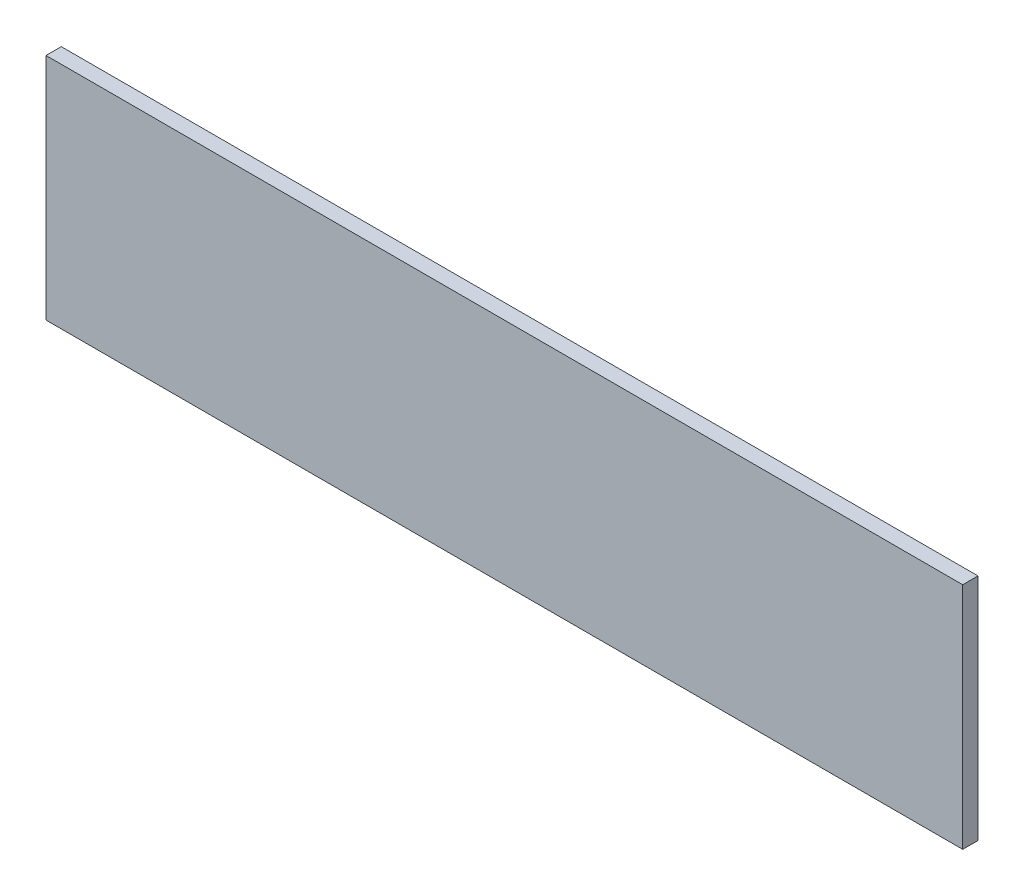
ISO-10303-21;
HEADER;
FILE_DESCRIPTION(('STEP AP214'),'2;1');
FILE_NAME('part.step','',(''),(''),'','','');
FILE_SCHEMA(('AUTOMOTIVE_DESIGN { 1 0 10303 214 1 1 1 1 }'));
ENDSEC;
DATA;
#1=APPLICATION_CONTEXT('core data for automotive mechanical design processes');
#2=APPLICATION_PROTOCOL_DEFINITION('international standard','automotive_design',2000,#1);
#3=PRODUCT_CONTEXT('',#1,'mechanical');
#4=PRODUCT('Part','Part','',(#3));
#5=PRODUCT_RELATED_PRODUCT_CATEGORY('part','',(#4));
#6=PRODUCT_DEFINITION_FORMATION('','',#4);
#7=PRODUCT_DEFINITION_CONTEXT('part definition',#1,'design');
#8=PRODUCT_DEFINITION('design','',#6,#7);
#9=PRODUCT_DEFINITION_SHAPE('','',#8);
#10=(LENGTH_UNIT() NAMED_UNIT(*) SI_UNIT(.MILLI.,.METRE.));
#11=(NAMED_UNIT(*) PLANE_ANGLE_UNIT() SI_UNIT($,.RADIAN.));
#12=(NAMED_UNIT(*) SI_UNIT($,.STERADIAN.) SOLID_ANGLE_UNIT());
#13=UNCERTAINTY_MEASURE_WITH_UNIT(LENGTH_MEASURE(1.E-05),#10,'distance_accuracy_value','');
#14=(GEOMETRIC_REPRESENTATION_CONTEXT(3) GLOBAL_UNCERTAINTY_ASSIGNED_CONTEXT((#13)) GLOBAL_UNIT_ASSIGNED_CONTEXT((#10,
#11,#12)) REPRESENTATION_CONTEXT('',''));
#15=CARTESIAN_POINT('',(0.,0.,0.));
#16=DIRECTION('',(0.,0.,1.));
#17=DIRECTION('',(1.,0.,0.));
#18=AXIS2_PLACEMENT_3D('',#15,#16,#17);
#19=CARTESIAN_POINT('',(0.,0.,0.4));
#20=DIRECTION('',(1.,0.,0.));
#21=DIRECTION('',(0.,0.,-1.));
#22=AXIS2_PLACEMENT_3D('',#19,#20,#21);
#23=PLANE('',#22);
#24=DIRECTION('',(0.,-1.,0.));
#25=VECTOR('',#24,1.);
#26=CARTESIAN_POINT('',(0.,0.,0.));
#27=LINE('',#26,#25);
#28=CARTESIAN_POINT('',(0.,6.,0.));
#29=VERTEX_POINT('',#28);
#30=CARTESIAN_POINT('',(0.,0.,0.));
#31=VERTEX_POINT('',#30);
#32=EDGE_CURVE('E95',#29,#31,#27,.T.);
#33=ORIENTED_EDGE('',*,*,#32,.T.);
#34=DIRECTION('',(0.,0.,-1.));
#35=VECTOR('',#34,1.);
#36=CARTESIAN_POINT('',(0.,0.,0.4));
#37=LINE('',#36,#35);
#38=CARTESIAN_POINT('',(0.,0.,0.4));
#39=VERTEX_POINT('',#38);
#40=EDGE_CURVE('E11',#39,#31,#37,.T.);
#41=ORIENTED_EDGE('',*,*,#40,.F.);
#42=DIRECTION('',(0.,-1.,0.));
#43=VECTOR('',#42,1.);
#44=CARTESIAN_POINT('',(0.,0.,0.4));
#45=LINE('',#44,#43);
#46=CARTESIAN_POINT('',(0.,6.,0.4));
#47=VERTEX_POINT('',#46);
#48=EDGE_CURVE('E83',#47,#39,#45,.T.);
#49=ORIENTED_EDGE('',*,*,#48,.F.);
#50=DIRECTION('',(0.,0.,-1.));
#51=VECTOR('',#50,1.);
#52=CARTESIAN_POINT('',(0.,6.,0.4));
#53=LINE('',#52,#51);
#54=EDGE_CURVE('E91',#47,#29,#53,.T.);
#55=ORIENTED_EDGE('',*,*,#54,.T.);
#56=EDGE_LOOP('',(#33,#41,#49,#55));
#57=FACE_BOUND('',#56,.T.);
#58=ADVANCED_FACE('F32',(#57),#23,.F.);
#59=CARTESIAN_POINT('',(0.,0.,0.4));
#60=DIRECTION('',(0.,1.,0.));
#61=DIRECTION('',(0.,0.,1.));
#62=AXIS2_PLACEMENT_3D('',#59,#60,#61);
#63=PLANE('',#62);
#64=DIRECTION('',(1.,0.,0.));
#65=VECTOR('',#64,1.);
#66=CARTESIAN_POINT('',(0.,0.,0.));
#67=LINE('',#66,#65);
#68=CARTESIAN_POINT('',(24.,0.,0.));
#69=VERTEX_POINT('',#68);
#70=EDGE_CURVE('E87',#31,#69,#67,.T.);
#71=ORIENTED_EDGE('',*,*,#70,.T.);
#72=DIRECTION('',(0.,0.,-1.));
#73=VECTOR('',#72,1.);
#74=CARTESIAN_POINT('',(24.,0.,0.4));
#75=LINE('',#74,#73);
#76=CARTESIAN_POINT('',(24.,0.,0.4));
#77=VERTEX_POINT('',#76);
#78=EDGE_CURVE('E40',#77,#69,#75,.T.);
#79=ORIENTED_EDGE('',*,*,#78,.F.);
#80=DIRECTION('',(1.,0.,0.));
#81=VECTOR('',#80,1.);
#82=CARTESIAN_POINT('',(0.,0.,0.4));
#83=LINE('',#82,#81);
#84=EDGE_CURVE('E78',#39,#77,#83,.T.);
#85=ORIENTED_EDGE('',*,*,#84,.F.);
#86=ORIENTED_EDGE('',*,*,#40,.T.);
#87=EDGE_LOOP('',(#71,#79,#85,#86));
#88=FACE_BOUND('',#87,.T.);
#89=ADVANCED_FACE('F86',(#88),#63,.F.);
#90=CARTESIAN_POINT('',(24.,0.,0.4));
#91=DIRECTION('',(-1.,0.,0.));
#92=DIRECTION('',(0.,0.,1.));
#93=AXIS2_PLACEMENT_3D('',#90,#91,#92);
#94=PLANE('',#93);
#95=DIRECTION('',(0.,1.,0.));
#96=VECTOR('',#95,1.);
#97=CARTESIAN_POINT('',(24.,0.,0.));
#98=LINE('',#97,#96);
#99=CARTESIAN_POINT('',(24.,6.,0.));
#100=VERTEX_POINT('',#99);
#101=EDGE_CURVE('E65',#69,#100,#98,.T.);
#102=ORIENTED_EDGE('',*,*,#101,.T.);
#103=DIRECTION('',(0.,0.,-1.));
#104=VECTOR('',#103,1.);
#105=CARTESIAN_POINT('',(24.,6.,0.4));
#106=LINE('',#105,#104);
#107=CARTESIAN_POINT('',(24.,6.,0.4));
#108=VERTEX_POINT('',#107);
#109=EDGE_CURVE('E88',#108,#100,#106,.T.);
#110=ORIENTED_EDGE('',*,*,#109,.F.);
#111=DIRECTION('',(0.,1.,0.));
#112=VECTOR('',#111,1.);
#113=CARTESIAN_POINT('',(24.,0.,0.4));
#114=LINE('',#113,#112);
#115=EDGE_CURVE('E81',#77,#108,#114,.T.);
#116=ORIENTED_EDGE('',*,*,#115,.F.);
#117=ORIENTED_EDGE('',*,*,#78,.T.);
#118=EDGE_LOOP('',(#102,#110,#116,#117));
#119=FACE_BOUND('',#118,.T.);
#120=ADVANCED_FACE('F89',(#119),#94,.F.);
#121=CARTESIAN_POINT('',(0.,6.,0.4));
#122=DIRECTION('',(0.,-1.,0.));
#123=DIRECTION('',(0.,0.,-1.));
#124=AXIS2_PLACEMENT_3D('',#121,#122,#123);
#125=PLANE('',#124);
#126=DIRECTION('',(-1.,0.,0.));
#127=VECTOR('',#126,1.);
#128=CARTESIAN_POINT('',(0.,6.,0.));
#129=LINE('',#128,#127);
#130=EDGE_CURVE('E71',#100,#29,#129,.T.);
#131=ORIENTED_EDGE('',*,*,#130,.T.);
#132=ORIENTED_EDGE('',*,*,#54,.F.);
#133=DIRECTION('',(-1.,0.,0.));
#134=VECTOR('',#133,1.);
#135=CARTESIAN_POINT('',(0.,6.,0.4));
#136=LINE('',#135,#134);
#137=EDGE_CURVE('E48',#108,#47,#136,.T.);
#138=ORIENTED_EDGE('',*,*,#137,.F.);
#139=ORIENTED_EDGE('',*,*,#109,.T.);
#140=EDGE_LOOP('',(#131,#132,#138,#139));
#141=FACE_BOUND('',#140,.T.);
#142=ADVANCED_FACE('F102',(#141),#125,.F.);
#143=CARTESIAN_POINT('',(0.,0.,0.4));
#144=DIRECTION('',(0.,0.,-1.));
#145=DIRECTION('',(-1.,0.,0.));
#146=AXIS2_PLACEMENT_3D('',#143,#144,#145);
#147=PLANE('',#146);
#148=ORIENTED_EDGE('',*,*,#48,.T.);
#149=ORIENTED_EDGE('',*,*,#84,.T.);
#150=ORIENTED_EDGE('',*,*,#115,.T.);
#151=ORIENTED_EDGE('',*,*,#137,.T.);
#152=EDGE_LOOP('',(#148,#149,#150,#151));
#153=FACE_BOUND('',#152,.T.);
#154=ADVANCED_FACE('F79',(#153),#147,.F.);
#155=CARTESIAN_POINT('',(0.,0.,0.));
#156=DIRECTION('',(0.,0.,-1.));
#157=DIRECTION('',(-1.,0.,0.));
#158=AXIS2_PLACEMENT_3D('',#155,#156,#157);
#159=PLANE('',#158);
#160=ORIENTED_EDGE('',*,*,#32,.F.);
#161=ORIENTED_EDGE('',*,*,#130,.F.);
#162=ORIENTED_EDGE('',*,*,#101,.F.);
#163=ORIENTED_EDGE('',*,*,#70,.F.);
#164=EDGE_LOOP('',(#160,#161,#162,#163));
#165=FACE_BOUND('',#164,.T.);
#166=ADVANCED_FACE('F105',(#165),#159,.T.);
#167=CLOSED_SHELL('',(#58,#89,#120,#142,#154,#166));
#168=MANIFOLD_SOLID_BREP('B2',#167);
#169=ADVANCED_BREP_SHAPE_REPRESENTATION('',(#18,#168),#14);
#170=SHAPE_DEFINITION_REPRESENTATION(#9,#169);
ENDSEC;
END-ISO-10303-21;
